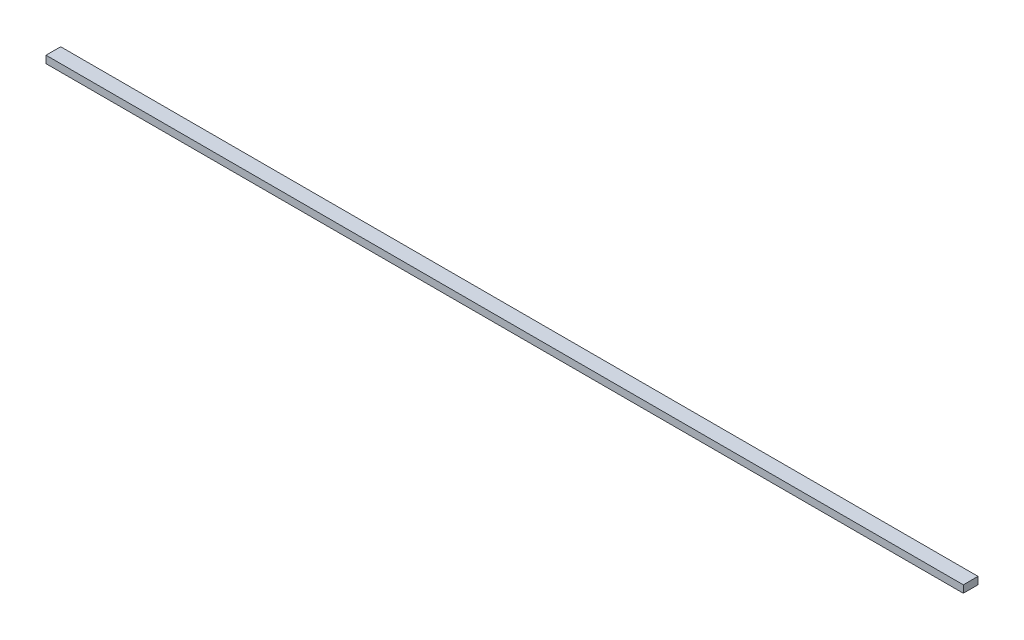
ISO-10303-21;
HEADER;
FILE_DESCRIPTION(('STEP AP214'),'2;1');
FILE_NAME('part.step','',(''),(''),'','','');
FILE_SCHEMA(('AUTOMOTIVE_DESIGN { 1 0 10303 214 1 1 1 1 }'));
ENDSEC;
DATA;
#1=APPLICATION_CONTEXT('core data for automotive mechanical design processes');
#2=APPLICATION_PROTOCOL_DEFINITION('international standard','automotive_design',2000,#1);
#3=PRODUCT_CONTEXT('',#1,'mechanical');
#4=PRODUCT('Part','Part','',(#3));
#5=PRODUCT_RELATED_PRODUCT_CATEGORY('part','',(#4));
#6=PRODUCT_DEFINITION_FORMATION('','',#4);
#7=PRODUCT_DEFINITION_CONTEXT('part definition',#1,'design');
#8=PRODUCT_DEFINITION('design','',#6,#7);
#9=PRODUCT_DEFINITION_SHAPE('','',#8);
#10=(LENGTH_UNIT() NAMED_UNIT(*) SI_UNIT(.MILLI.,.METRE.));
#11=(NAMED_UNIT(*) PLANE_ANGLE_UNIT() SI_UNIT($,.RADIAN.));
#12=(NAMED_UNIT(*) SI_UNIT($,.STERADIAN.) SOLID_ANGLE_UNIT());
#13=UNCERTAINTY_MEASURE_WITH_UNIT(LENGTH_MEASURE(1.E-05),#10,'distance_accuracy_value','');
#14=(GEOMETRIC_REPRESENTATION_CONTEXT(3) GLOBAL_UNCERTAINTY_ASSIGNED_CONTEXT((#13)) GLOBAL_UNIT_ASSIGNED_CONTEXT((#10,
#11,#12)) REPRESENTATION_CONTEXT('',''));
#15=CARTESIAN_POINT('',(0.,0.,0.));
#16=DIRECTION('',(0.,0.,1.));
#17=DIRECTION('',(1.,0.,0.));
#18=AXIS2_PLACEMENT_3D('',#15,#16,#17);
#19=CARTESIAN_POINT('',(-625.,10.,-9.99999999999998));
#20=DIRECTION('',(1.,0.,0.));
#21=DIRECTION('',(0.,0.,-1.));
#22=AXIS2_PLACEMENT_3D('',#19,#20,#21);
#23=PLANE('',#22);
#24=DIRECTION('',(0.,0.,1.));
#25=VECTOR('',#24,1.);
#26=CARTESIAN_POINT('',(-625.,0.,-9.99999999999998));
#27=LINE('',#26,#25);
#28=CARTESIAN_POINT('',(-625.,0.,-9.99999999999998));
#29=VERTEX_POINT('',#28);
#30=CARTESIAN_POINT('',(-625.,0.,10.));
#31=VERTEX_POINT('',#30);
#32=EDGE_CURVE('E95',#29,#31,#27,.T.);
#33=ORIENTED_EDGE('',*,*,#32,.T.);
#34=DIRECTION('',(0.,-1.,0.));
#35=VECTOR('',#34,1.);
#36=CARTESIAN_POINT('',(-625.,10.,10.));
#37=LINE('',#36,#35);
#38=CARTESIAN_POINT('',(-625.,10.,10.));
#39=VERTEX_POINT('',#38);
#40=EDGE_CURVE('E11',#39,#31,#37,.T.);
#41=ORIENTED_EDGE('',*,*,#40,.F.);
#42=DIRECTION('',(0.,0.,1.));
#43=VECTOR('',#42,1.);
#44=CARTESIAN_POINT('',(-625.,10.,-9.99999999999998));
#45=LINE('',#44,#43);
#46=CARTESIAN_POINT('',(-625.,10.,-9.99999999999998));
#47=VERTEX_POINT('',#46);
#48=EDGE_CURVE('E83',#47,#39,#45,.T.);
#49=ORIENTED_EDGE('',*,*,#48,.F.);
#50=DIRECTION('',(0.,-1.,0.));
#51=VECTOR('',#50,1.);
#52=CARTESIAN_POINT('',(-625.,10.,-9.99999999999998));
#53=LINE('',#52,#51);
#54=EDGE_CURVE('E91',#47,#29,#53,.T.);
#55=ORIENTED_EDGE('',*,*,#54,.T.);
#56=EDGE_LOOP('',(#33,#41,#49,#55));
#57=FACE_BOUND('',#56,.T.);
#58=ADVANCED_FACE('F32',(#57),#23,.F.);
#59=CARTESIAN_POINT('',(-625.,10.,10.));
#60=DIRECTION('',(0.,0.,-1.));
#61=DIRECTION('',(-1.,0.,0.));
#62=AXIS2_PLACEMENT_3D('',#59,#60,#61);
#63=PLANE('',#62);
#64=DIRECTION('',(1.,0.,0.));
#65=VECTOR('',#64,1.);
#66=CARTESIAN_POINT('',(-625.,0.,10.));
#67=LINE('',#66,#65);
#68=CARTESIAN_POINT('',(625.,0.,10.));
#69=VERTEX_POINT('',#68);
#70=EDGE_CURVE('E87',#31,#69,#67,.T.);
#71=ORIENTED_EDGE('',*,*,#70,.T.);
#72=DIRECTION('',(0.,-1.,0.));
#73=VECTOR('',#72,1.);
#74=CARTESIAN_POINT('',(625.,10.,10.));
#75=LINE('',#74,#73);
#76=CARTESIAN_POINT('',(625.,10.,10.));
#77=VERTEX_POINT('',#76);
#78=EDGE_CURVE('E40',#77,#69,#75,.T.);
#79=ORIENTED_EDGE('',*,*,#78,.F.);
#80=DIRECTION('',(1.,0.,0.));
#81=VECTOR('',#80,1.);
#82=CARTESIAN_POINT('',(-625.,10.,10.));
#83=LINE('',#82,#81);
#84=EDGE_CURVE('E78',#39,#77,#83,.T.);
#85=ORIENTED_EDGE('',*,*,#84,.F.);
#86=ORIENTED_EDGE('',*,*,#40,.T.);
#87=EDGE_LOOP('',(#71,#79,#85,#86));
#88=FACE_BOUND('',#87,.T.);
#89=ADVANCED_FACE('F86',(#88),#63,.F.);
#90=CARTESIAN_POINT('',(625.,10.,-9.99999999999998));
#91=DIRECTION('',(-1.,0.,0.));
#92=DIRECTION('',(0.,0.,1.));
#93=AXIS2_PLACEMENT_3D('',#90,#91,#92);
#94=PLANE('',#93);
#95=DIRECTION('',(0.,0.,-1.));
#96=VECTOR('',#95,1.);
#97=CARTESIAN_POINT('',(625.,0.,-9.99999999999998));
#98=LINE('',#97,#96);
#99=CARTESIAN_POINT('',(625.,0.,-9.99999999999998));
#100=VERTEX_POINT('',#99);
#101=EDGE_CURVE('E65',#69,#100,#98,.T.);
#102=ORIENTED_EDGE('',*,*,#101,.T.);
#103=DIRECTION('',(0.,-1.,0.));
#104=VECTOR('',#103,1.);
#105=CARTESIAN_POINT('',(625.,10.,-9.99999999999998));
#106=LINE('',#105,#104);
#107=CARTESIAN_POINT('',(625.,10.,-9.99999999999998));
#108=VERTEX_POINT('',#107);
#109=EDGE_CURVE('E88',#108,#100,#106,.T.);
#110=ORIENTED_EDGE('',*,*,#109,.F.);
#111=DIRECTION('',(0.,0.,-1.));
#112=VECTOR('',#111,1.);
#113=CARTESIAN_POINT('',(625.,10.,-9.99999999999998));
#114=LINE('',#113,#112);
#115=EDGE_CURVE('E81',#77,#108,#114,.T.);
#116=ORIENTED_EDGE('',*,*,#115,.F.);
#117=ORIENTED_EDGE('',*,*,#78,.T.);
#118=EDGE_LOOP('',(#102,#110,#116,#117));
#119=FACE_BOUND('',#118,.T.);
#120=ADVANCED_FACE('F89',(#119),#94,.F.);
#121=CARTESIAN_POINT('',(-625.,10.,-9.99999999999998));
#122=DIRECTION('',(0.,0.,1.));
#123=DIRECTION('',(1.,0.,0.));
#124=AXIS2_PLACEMENT_3D('',#121,#122,#123);
#125=PLANE('',#124);
#126=DIRECTION('',(-1.,0.,0.));
#127=VECTOR('',#126,1.);
#128=CARTESIAN_POINT('',(-625.,0.,-9.99999999999998));
#129=LINE('',#128,#127);
#130=EDGE_CURVE('E71',#100,#29,#129,.T.);
#131=ORIENTED_EDGE('',*,*,#130,.T.);
#132=ORIENTED_EDGE('',*,*,#54,.F.);
#133=DIRECTION('',(-1.,0.,0.));
#134=VECTOR('',#133,1.);
#135=CARTESIAN_POINT('',(-625.,10.,-9.99999999999998));
#136=LINE('',#135,#134);
#137=EDGE_CURVE('E48',#108,#47,#136,.T.);
#138=ORIENTED_EDGE('',*,*,#137,.F.);
#139=ORIENTED_EDGE('',*,*,#109,.T.);
#140=EDGE_LOOP('',(#131,#132,#138,#139));
#141=FACE_BOUND('',#140,.T.);
#142=ADVANCED_FACE('F102',(#141),#125,.F.);
#143=CARTESIAN_POINT('',(0.,10.,0.));
#144=DIRECTION('',(0.,1.,0.));
#145=DIRECTION('',(0.,0.,1.));
#146=AXIS2_PLACEMENT_3D('',#143,#144,#145);
#147=PLANE('',#146);
#148=ORIENTED_EDGE('',*,*,#48,.T.);
#149=ORIENTED_EDGE('',*,*,#84,.T.);
#150=ORIENTED_EDGE('',*,*,#115,.T.);
#151=ORIENTED_EDGE('',*,*,#137,.T.);
#152=EDGE_LOOP('',(#148,#149,#150,#151));
#153=FACE_BOUND('',#152,.T.);
#154=ADVANCED_FACE('F79',(#153),#147,.T.);
#155=CARTESIAN_POINT('',(0.,0.,0.));
#156=DIRECTION('',(0.,1.,0.));
#157=DIRECTION('',(0.,0.,1.));
#158=AXIS2_PLACEMENT_3D('',#155,#156,#157);
#159=PLANE('',#158);
#160=ORIENTED_EDGE('',*,*,#32,.F.);
#161=ORIENTED_EDGE('',*,*,#130,.F.);
#162=ORIENTED_EDGE('',*,*,#101,.F.);
#163=ORIENTED_EDGE('',*,*,#70,.F.);
#164=EDGE_LOOP('',(#160,#161,#162,#163));
#165=FACE_BOUND('',#164,.T.);
#166=ADVANCED_FACE('F105',(#165),#159,.F.);
#167=CLOSED_SHELL('',(#58,#89,#120,#142,#154,#166));
#168=MANIFOLD_SOLID_BREP('B2',#167);
#169=ADVANCED_BREP_SHAPE_REPRESENTATION('',(#18,#168),#14);
#170=SHAPE_DEFINITION_REPRESENTATION(#9,#169);
ENDSEC;
END-ISO-10303-21;
